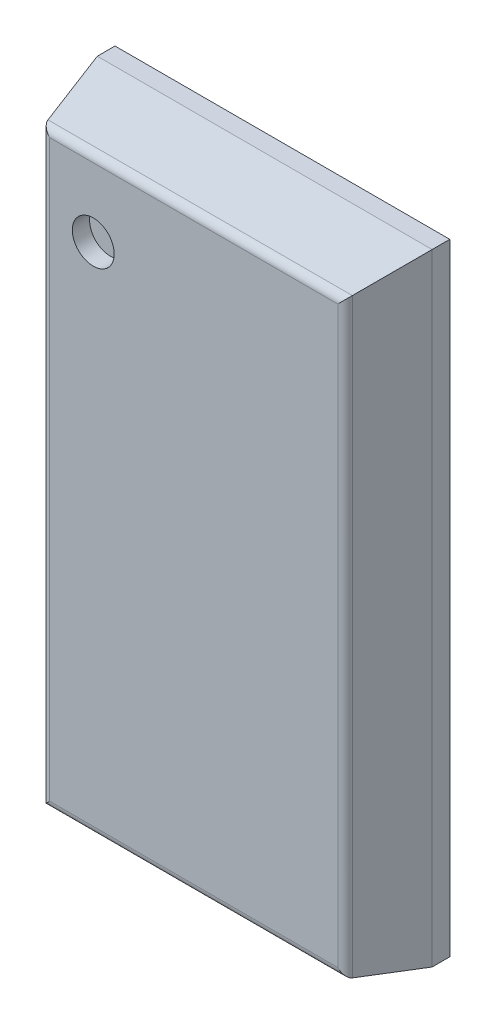
ISO-10303-21;
HEADER;
FILE_DESCRIPTION(('STEP AP214'),'2;1');
FILE_NAME('part.step','',(''),(''),'','','');
FILE_SCHEMA(('AUTOMOTIVE_DESIGN { 1 0 10303 214 1 1 1 1 }'));
ENDSEC;
DATA;
#1=APPLICATION_CONTEXT('core data for automotive mechanical design processes');
#2=APPLICATION_PROTOCOL_DEFINITION('international standard','automotive_design',2000,#1);
#3=PRODUCT_CONTEXT('',#1,'mechanical');
#4=PRODUCT('Part','Part','',(#3));
#5=PRODUCT_RELATED_PRODUCT_CATEGORY('part','',(#4));
#6=PRODUCT_DEFINITION_FORMATION('','',#4);
#7=PRODUCT_DEFINITION_CONTEXT('part definition',#1,'design');
#8=PRODUCT_DEFINITION('design','',#6,#7);
#9=PRODUCT_DEFINITION_SHAPE('','',#8);
#10=(LENGTH_UNIT() NAMED_UNIT(*) SI_UNIT(.MILLI.,.METRE.));
#11=(NAMED_UNIT(*) PLANE_ANGLE_UNIT() SI_UNIT($,.RADIAN.));
#12=(NAMED_UNIT(*) SI_UNIT($,.STERADIAN.) SOLID_ANGLE_UNIT());
#13=UNCERTAINTY_MEASURE_WITH_UNIT(LENGTH_MEASURE(1.E-05),#10,'distance_accuracy_value','');
#14=(GEOMETRIC_REPRESENTATION_CONTEXT(3) GLOBAL_UNCERTAINTY_ASSIGNED_CONTEXT((#13)) GLOBAL_UNIT_ASSIGNED_CONTEXT((#10,
#11,#12)) REPRESENTATION_CONTEXT('',''));
#15=CARTESIAN_POINT('',(0.,0.,0.));
#16=DIRECTION('',(0.,0.,1.));
#17=DIRECTION('',(1.,0.,0.));
#18=AXIS2_PLACEMENT_3D('',#15,#16,#17);
#19=CARTESIAN_POINT('',(-1.0515,2.29,1.62));
#20=DIRECTION('',(0.,0.,1.));
#21=DIRECTION('',(1.,0.,0.));
#22=AXIS2_PLACEMENT_3D('',#19,#20,#21);
#23=PLANE('',#22);
#24=CARTESIAN_POINT('',(-1.0515,2.29,1.62));
#25=DIRECTION('',(0.,0.,1.));
#26=DIRECTION('',(1.,0.,0.));
#27=AXIS2_PLACEMENT_3D('',#24,#25,#26);
#28=CIRCLE('',#27,0.2190625);
#29=CARTESIAN_POINT('',(-0.8324375,2.29,1.62));
#30=VERTEX_POINT('',#29);
#31=EDGE_CURVE('E26',#30,#30,#28,.T.);
#32=ORIENTED_EDGE('',*,*,#31,.T.);
#33=EDGE_LOOP('',(#32));
#34=FACE_BOUND('',#33,.T.);
#35=ADVANCED_FACE('F17',(#34),#23,.T.);
#36=CARTESIAN_POINT('',(-1.0515,2.29,1.62));
#37=DIRECTION('',(0.,0.,1.));
#38=DIRECTION('',(1.,0.,0.));
#39=AXIS2_PLACEMENT_3D('',#36,#37,#38);
#40=CYLINDRICAL_SURFACE('',#39,0.2190625);
#41=ORIENTED_EDGE('',*,*,#31,.F.);
#42=DIRECTION('',(0.,0.,1.));
#43=VECTOR('',#42,1.);
#44=CARTESIAN_POINT('',(-0.8324375,2.29,1.62));
#45=LINE('',#44,#43);
#46=CARTESIAN_POINT('',(-0.8324375,2.29,1.8));
#47=VERTEX_POINT('',#46);
#48=EDGE_CURVE('E11',#30,#47,#45,.T.);
#49=ORIENTED_EDGE('',*,*,#48,.T.);
#50=CARTESIAN_POINT('',(-1.0515,2.29,1.8));
#51=DIRECTION('',(0.,0.,1.));
#52=DIRECTION('',(1.,0.,0.));
#53=AXIS2_PLACEMENT_3D('',#50,#51,#52);
#54=CIRCLE('',#53,0.2190625);
#55=EDGE_CURVE('E209',#47,#47,#54,.T.);
#56=ORIENTED_EDGE('',*,*,#55,.T.);
#57=ORIENTED_EDGE('',*,*,#48,.F.);
#58=EDGE_LOOP('',(#41,#49,#56,#57));
#59=FACE_BOUND('',#58,.T.);
#60=ADVANCED_FACE('F671',(#59),#40,.F.);
#61=CARTESIAN_POINT('',(1.507884257852,-3.07725,1.712375));
#62=DIRECTION('',(0.,1.,0.));
#63=DIRECTION('',(0.,0.,1.));
#64=AXIS2_PLACEMENT_3D('',#61,#62,#63);
#65=CYLINDRICAL_SURFACE('',#64,0.087625);
#66=CARTESIAN_POINT('',(1.507884257852,-3.007884257852,1.712375));
#67=DIRECTION('',(-0.707106781186548,-0.707106781186548,0.));
#68=DIRECTION('',(0.707106781186548,-0.707106781186548,0.));
#69=AXIS2_PLACEMENT_3D('',#66,#67,#68);
#70=ELLIPSE('',#69,0.123920463403,0.087625);
#71=CARTESIAN_POINT('',(1.593170201742,-3.093170201742,1.732485902507));
#72=VERTEX_POINT('',#71);
#73=CARTESIAN_POINT('',(1.507884257852,-3.007884257852,1.8));
#74=VERTEX_POINT('',#73);
#75=EDGE_CURVE('E208',#72,#74,#70,.T.);
#76=ORIENTED_EDGE('',*,*,#75,.F.);
#77=DIRECTION('',(0.,1.,0.));
#78=VECTOR('',#77,1.);
#79=CARTESIAN_POINT('',(1.593170201742,-3.07725,1.732485902507));
#80=LINE('',#79,#78);
#81=CARTESIAN_POINT('',(1.593170201742,3.093170201742,1.732485902507));
#82=VERTEX_POINT('',#81);
#83=EDGE_CURVE('E152',#72,#82,#80,.T.);
#84=ORIENTED_EDGE('',*,*,#83,.T.);
#85=CARTESIAN_POINT('',(1.507884257852,3.007884257852,1.712375));
#86=DIRECTION('',(-0.707106781186548,0.707106781186548,0.));
#87=DIRECTION('',(0.707106781186548,0.707106781186548,0.));
#88=AXIS2_PLACEMENT_3D('',#85,#86,#87);
#89=ELLIPSE('',#88,0.123920463403,0.087625);
#90=CARTESIAN_POINT('',(1.507884257852,3.007884257852,1.8));
#91=VERTEX_POINT('',#90);
#92=EDGE_CURVE('E20',#91,#82,#89,.T.);
#93=ORIENTED_EDGE('',*,*,#92,.F.);
#94=DIRECTION('',(0.,1.,0.));
#95=VECTOR('',#94,1.);
#96=CARTESIAN_POINT('',(1.507884257852,-3.07725,1.8));
#97=LINE('',#96,#95);
#98=EDGE_CURVE('E218',#74,#91,#97,.T.);
#99=ORIENTED_EDGE('',*,*,#98,.F.);
#100=EDGE_LOOP('',(#76,#84,#93,#99));
#101=FACE_BOUND('',#100,.T.);
#102=ADVANCED_FACE('F340',(#101),#65,.T.);
#103=CARTESIAN_POINT('',(-1.57725,3.007884257852,1.712375));
#104=DIRECTION('',(1.,0.,0.));
#105=DIRECTION('',(0.,0.,1.));
#106=AXIS2_PLACEMENT_3D('',#103,#104,#105);
#107=CYLINDRICAL_SURFACE('',#106,0.087625);
#108=DIRECTION('',(1.,0.,0.));
#109=VECTOR('',#108,1.);
#110=CARTESIAN_POINT('',(-1.57725,3.007884257852,1.8));
#111=LINE('',#110,#109);
#112=CARTESIAN_POINT('',(-1.507884257852,3.007884257852,1.8));
#113=VERTEX_POINT('',#112);
#114=EDGE_CURVE('E212',#113,#91,#111,.T.);
#115=ORIENTED_EDGE('',*,*,#114,.T.);
#116=ORIENTED_EDGE('',*,*,#92,.T.);
#117=DIRECTION('',(1.,0.,0.));
#118=VECTOR('',#117,1.);
#119=CARTESIAN_POINT('',(-1.57725,3.093170201742,1.732485902507));
#120=LINE('',#119,#118);
#121=CARTESIAN_POINT('',(-1.593170201742,3.093170201742,1.732485902507));
#122=VERTEX_POINT('',#121);
#123=EDGE_CURVE('E148',#122,#82,#120,.T.);
#124=ORIENTED_EDGE('',*,*,#123,.F.);
#125=CARTESIAN_POINT('',(-1.507884257852,3.007884257852,1.712375));
#126=DIRECTION('',(0.707106781186548,0.707106781186548,0.));
#127=DIRECTION('',(-0.707106781186548,0.707106781186548,0.));
#128=AXIS2_PLACEMENT_3D('',#125,#126,#127);
#129=ELLIPSE('',#128,0.123920463403,0.087625);
#130=EDGE_CURVE('E201',#122,#113,#129,.T.);
#131=ORIENTED_EDGE('',*,*,#130,.T.);
#132=EDGE_LOOP('',(#115,#116,#124,#131));
#133=FACE_BOUND('',#132,.T.);
#134=ADVANCED_FACE('F337',(#133),#107,.T.);
#135=CARTESIAN_POINT('',(-1.7525,-3.2525,1.8));
#136=DIRECTION('',(0.,0.,1.));
#137=DIRECTION('',(1.,0.,0.));
#138=AXIS2_PLACEMENT_3D('',#135,#136,#137);
#139=PLANE('',#138);
#140=ORIENTED_EDGE('',*,*,#55,.F.);
#141=EDGE_LOOP('',(#140));
#142=FACE_BOUND('',#141,.T.);
#143=DIRECTION('',(0.,1.,0.));
#144=VECTOR('',#143,1.);
#145=CARTESIAN_POINT('',(-1.507884257852,-3.07725,1.8));
#146=LINE('',#145,#144);
#147=CARTESIAN_POINT('',(-1.507884257852,-3.007884257852,1.8));
#148=VERTEX_POINT('',#147);
#149=EDGE_CURVE('E197',#148,#113,#146,.T.);
#150=ORIENTED_EDGE('',*,*,#149,.F.);
#151=DIRECTION('',(1.,0.,0.));
#152=VECTOR('',#151,1.);
#153=CARTESIAN_POINT('',(-1.57725,-3.007884257852,1.8));
#154=LINE('',#153,#152);
#155=EDGE_CURVE('E215',#148,#74,#154,.T.);
#156=ORIENTED_EDGE('',*,*,#155,.T.);
#157=ORIENTED_EDGE('',*,*,#98,.T.);
#158=ORIENTED_EDGE('',*,*,#114,.F.);
#159=EDGE_LOOP('',(#150,#156,#157,#158));
#160=FACE_BOUND('',#159,.T.);
#161=ADVANCED_FACE('F520',(#142,#160),#139,.T.);
#162=CARTESIAN_POINT('',(-1.57725,-3.007884257852,1.712375));
#163=DIRECTION('',(1.,0.,0.));
#164=DIRECTION('',(0.,-0.973306064374652,0.229511012919918));
#165=AXIS2_PLACEMENT_3D('',#162,#163,#164);
#166=CYLINDRICAL_SURFACE('',#165,0.087625);
#167=DIRECTION('',(1.,0.,0.));
#168=VECTOR('',#167,1.);
#169=CARTESIAN_POINT('',(-1.57725,-3.093170201742,1.732485902507));
#170=LINE('',#169,#168);
#171=CARTESIAN_POINT('',(-1.593170201742,-3.093170201742,1.732485902507));
#172=VERTEX_POINT('',#171);
#173=EDGE_CURVE('E192',#172,#72,#170,.T.);
#174=ORIENTED_EDGE('',*,*,#173,.T.);
#175=ORIENTED_EDGE('',*,*,#75,.T.);
#176=ORIENTED_EDGE('',*,*,#155,.F.);
#177=CARTESIAN_POINT('',(-1.507884257852,-3.007884257852,1.712375));
#178=DIRECTION('',(-0.707106781186548,0.707106781186548,0.));
#179=DIRECTION('',(0.707106781186548,0.707106781186548,0.));
#180=AXIS2_PLACEMENT_3D('',#177,#178,#179);
#181=ELLIPSE('',#180,0.123920463403,0.087625);
#182=EDGE_CURVE('E196',#172,#148,#181,.T.);
#183=ORIENTED_EDGE('',*,*,#182,.F.);
#184=EDGE_LOOP('',(#174,#175,#176,#183));
#185=FACE_BOUND('',#184,.T.);
#186=ADVANCED_FACE('F343',(#185),#166,.T.);
#187=CARTESIAN_POINT('',(1.664875,-3.2525,1.42840151849));
#188=DIRECTION('',(0.973306064374652,0.,0.229511012919918));
#189=DIRECTION('',(0.,-1.,0.));
#190=AXIS2_PLACEMENT_3D('',#187,#188,#189);
#191=PLANE('',#190);
#192=DIRECTION('',(-0.223695018205087,0.223695018205087,0.948641701413369));
#193=VECTOR('',#192,1.);
#194=CARTESIAN_POINT('',(1.581565552085,-3.081565552085,1.781698686428));
#195=LINE('',#194,#193);
#196=CARTESIAN_POINT('',(1.7525,-3.2525,1.056803036979));
#197=VERTEX_POINT('',#196);
#198=EDGE_CURVE('E158',#197,#72,#195,.T.);
#199=ORIENTED_EDGE('',*,*,#198,.F.);
#200=DIRECTION('',(0.,1.,0.));
#201=VECTOR('',#200,1.);
#202=CARTESIAN_POINT('',(1.7525,-3.2525,1.056803036979));
#203=LINE('',#202,#201);
#204=CARTESIAN_POINT('',(1.7525,3.2525,1.056803036979));
#205=VERTEX_POINT('',#204);
#206=EDGE_CURVE('E155',#197,#205,#203,.T.);
#207=ORIENTED_EDGE('',*,*,#206,.T.);
#208=DIRECTION('',(-0.223695018205087,-0.223695018205087,0.948641701413369));
#209=VECTOR('',#208,1.);
#210=CARTESIAN_POINT('',(1.418812204631,2.918812204631,2.471900076154));
#211=LINE('',#210,#209);
#212=EDGE_CURVE('E141',#205,#82,#211,.T.);
#213=ORIENTED_EDGE('',*,*,#212,.T.);
#214=ORIENTED_EDGE('',*,*,#83,.F.);
#215=EDGE_LOOP('',(#199,#207,#213,#214));
#216=FACE_BOUND('',#215,.T.);
#217=ADVANCED_FACE('F156',(#216),#191,.T.);
#218=CARTESIAN_POINT('',(-1.7525,3.164875,1.42840151849));
#219=DIRECTION('',(0.,0.973306064374652,0.229511012919918));
#220=DIRECTION('',(1.,0.,0.));
#221=AXIS2_PLACEMENT_3D('',#218,#219,#220);
#222=PLANE('',#221);
#223=ORIENTED_EDGE('',*,*,#123,.T.);
#224=ORIENTED_EDGE('',*,*,#212,.F.);
#225=DIRECTION('',(1.,0.,0.));
#226=VECTOR('',#225,1.);
#227=CARTESIAN_POINT('',(-1.7525,3.2525,1.056803036979));
#228=LINE('',#227,#226);
#229=CARTESIAN_POINT('',(-1.7525,3.2525,1.056803036979));
#230=VERTEX_POINT('',#229);
#231=EDGE_CURVE('E146',#230,#205,#228,.T.);
#232=ORIENTED_EDGE('',*,*,#231,.F.);
#233=DIRECTION('',(0.223695018205087,-0.223695018205087,0.948641701413369));
#234=VECTOR('',#233,1.);
#235=CARTESIAN_POINT('',(-1.506506360331,3.006506360331,2.10000832043));
#236=LINE('',#235,#234);
#237=EDGE_CURVE('E186',#230,#122,#236,.T.);
#238=ORIENTED_EDGE('',*,*,#237,.T.);
#239=EDGE_LOOP('',(#223,#224,#232,#238));
#240=FACE_BOUND('',#239,.T.);
#241=ADVANCED_FACE('F143',(#240),#222,.T.);
#242=CARTESIAN_POINT('',(-1.507884257852,-3.07725,1.712375));
#243=DIRECTION('',(0.,1.,0.));
#244=DIRECTION('',(-0.973306064374652,0.,0.229511012919918));
#245=AXIS2_PLACEMENT_3D('',#242,#243,#244);
#246=CYLINDRICAL_SURFACE('',#245,0.087625);
#247=ORIENTED_EDGE('',*,*,#182,.T.);
#248=ORIENTED_EDGE('',*,*,#149,.T.);
#249=ORIENTED_EDGE('',*,*,#130,.F.);
#250=DIRECTION('',(0.,1.,0.));
#251=VECTOR('',#250,1.);
#252=CARTESIAN_POINT('',(-1.593170201742,-3.07725,1.732485902507));
#253=LINE('',#252,#251);
#254=EDGE_CURVE('E304',#172,#122,#253,.T.);
#255=ORIENTED_EDGE('',*,*,#254,.F.);
#256=EDGE_LOOP('',(#247,#248,#249,#255));
#257=FACE_BOUND('',#256,.T.);
#258=ADVANCED_FACE('F335',(#257),#246,.T.);
#259=CARTESIAN_POINT('',(-1.7525,-3.164875,1.42840151849));
#260=DIRECTION('',(0.,0.973306064374652,-0.229511012919918));
#261=DIRECTION('',(-1.,0.,0.));
#262=AXIS2_PLACEMENT_3D('',#259,#260,#261);
#263=PLANE('',#262);
#264=DIRECTION('',(0.223695018205087,0.223695018205087,0.948641701413369));
#265=VECTOR('',#264,1.);
#266=CARTESIAN_POINT('',(-1.669259707785,-3.169259707785,1.409806930703));
#267=LINE('',#266,#265);
#268=CARTESIAN_POINT('',(-1.7525,-3.2525,1.056803036979));
#269=VERTEX_POINT('',#268);
#270=EDGE_CURVE('E179',#269,#172,#267,.T.);
#271=ORIENTED_EDGE('',*,*,#270,.F.);
#272=DIRECTION('',(1.,0.,0.));
#273=VECTOR('',#272,1.);
#274=CARTESIAN_POINT('',(-1.7525,-3.2525,1.056803036979));
#275=LINE('',#274,#273);
#276=EDGE_CURVE('E289',#269,#197,#275,.T.);
#277=ORIENTED_EDGE('',*,*,#276,.T.);
#278=ORIENTED_EDGE('',*,*,#198,.T.);
#279=ORIENTED_EDGE('',*,*,#173,.F.);
#280=EDGE_LOOP('',(#271,#277,#278,#279));
#281=FACE_BOUND('',#280,.T.);
#282=ADVANCED_FACE('F345',(#281),#263,.F.);
#283=CARTESIAN_POINT('',(1.7525,-3.2525,0.74));
#284=DIRECTION('',(1.,0.,0.));
#285=DIRECTION('',(0.,1.,0.));
#286=AXIS2_PLACEMENT_3D('',#283,#284,#285);
#287=PLANE('',#286);
#288=DIRECTION('',(0.,0.,1.));
#289=VECTOR('',#288,1.);
#290=CARTESIAN_POINT('',(1.7525,-3.2525,0.74));
#291=LINE('',#290,#289);
#292=CARTESIAN_POINT('',(1.7525,-3.2525,0.871803036979));
#293=VERTEX_POINT('',#292);
#294=EDGE_CURVE('E285',#293,#197,#291,.T.);
#295=ORIENTED_EDGE('',*,*,#294,.F.);
#296=DIRECTION('',(0.,1.,0.));
#297=VECTOR('',#296,1.);
#298=CARTESIAN_POINT('',(1.7525,-3.2525,0.871803036979));
#299=LINE('',#298,#297);
#300=CARTESIAN_POINT('',(1.7525,3.2525,0.871803036979));
#301=VERTEX_POINT('',#300);
#302=EDGE_CURVE('E176',#293,#301,#299,.T.);
#303=ORIENTED_EDGE('',*,*,#302,.T.);
#304=DIRECTION('',(0.,0.,1.));
#305=VECTOR('',#304,1.);
#306=CARTESIAN_POINT('',(1.7525,3.2525,0.74));
#307=LINE('',#306,#305);
#308=EDGE_CURVE('E168',#301,#205,#307,.T.);
#309=ORIENTED_EDGE('',*,*,#308,.T.);
#310=ORIENTED_EDGE('',*,*,#206,.F.);
#311=EDGE_LOOP('',(#295,#303,#309,#310));
#312=FACE_BOUND('',#311,.T.);
#313=ADVANCED_FACE('F175',(#312),#287,.T.);
#314=CARTESIAN_POINT('',(1.547976732908,-3.07725,0.827625));
#315=DIRECTION('',(0.,1.,0.));
#316=DIRECTION('',(0.,0.,-1.));
#317=AXIS2_PLACEMENT_3D('',#314,#315,#316);
#318=CYLINDRICAL_SURFACE('',#317,0.087625);
#319=DIRECTION('',(0.,1.,0.));
#320=VECTOR('',#319,1.);
#321=CARTESIAN_POINT('',(1.547976732908,-3.07725,0.74));
#322=LINE('',#321,#320);
#323=CARTESIAN_POINT('',(1.547976732908,-3.047976732908,0.74));
#324=VERTEX_POINT('',#323);
#325=CARTESIAN_POINT('',(1.547976732908,3.047976732908,0.74));
#326=VERTEX_POINT('',#325);
#327=EDGE_CURVE('E321',#324,#326,#322,.T.);
#328=ORIENTED_EDGE('',*,*,#327,.T.);
#329=CARTESIAN_POINT('',(1.547976732908,3.047976732908,0.827625));
#330=DIRECTION('',(0.707106781186548,-0.707106781186548,0.));
#331=DIRECTION('',(0.707106781186548,0.707106781186548,0.));
#332=AXIS2_PLACEMENT_3D('',#329,#330,#331);
#333=ELLIPSE('',#332,0.123920463403,0.087625);
#334=CARTESIAN_POINT('',(1.600645169946,3.100645169946,0.757595175176));
#335=VERTEX_POINT('',#334);
#336=EDGE_CURVE('E308',#326,#335,#333,.T.);
#337=ORIENTED_EDGE('',*,*,#336,.T.);
#338=DIRECTION('',(0.,1.,0.));
#339=VECTOR('',#338,1.);
#340=CARTESIAN_POINT('',(1.600645169946,-3.07725,0.757595175176));
#341=LINE('',#340,#339);
#342=CARTESIAN_POINT('',(1.600645169946,-3.100645169946,0.757595175176));
#343=VERTEX_POINT('',#342);
#344=EDGE_CURVE('E288',#343,#335,#341,.T.);
#345=ORIENTED_EDGE('',*,*,#344,.F.);
#346=CARTESIAN_POINT('',(1.547976732908,-3.047976732908,0.827625));
#347=DIRECTION('',(0.707106781186548,0.707106781186548,0.));
#348=DIRECTION('',(0.707106781186548,-0.707106781186548,0.));
#349=AXIS2_PLACEMENT_3D('',#346,#347,#348);
#350=ELLIPSE('',#349,0.123920463403,0.087625);
#351=EDGE_CURVE('E296',#343,#324,#350,.T.);
#352=ORIENTED_EDGE('',*,*,#351,.T.);
#353=EDGE_LOOP('',(#328,#337,#345,#352));
#354=FACE_BOUND('',#353,.T.);
#355=ADVANCED_FACE('F602',(#354),#318,.T.);
#356=CARTESIAN_POINT('',(-1.7525,3.2525,0.74));
#357=DIRECTION('',(0.,1.,0.));
#358=DIRECTION('',(1.,0.,0.));
#359=AXIS2_PLACEMENT_3D('',#356,#357,#358);
#360=PLANE('',#359);
#361=ORIENTED_EDGE('',*,*,#308,.F.);
#362=DIRECTION('',(1.,0.,0.));
#363=VECTOR('',#362,1.);
#364=CARTESIAN_POINT('',(-1.7525,3.2525,0.871803036979));
#365=LINE('',#364,#363);
#366=CARTESIAN_POINT('',(-1.7525,3.2525,0.871803036979));
#367=VERTEX_POINT('',#366);
#368=EDGE_CURVE('E240',#367,#301,#365,.T.);
#369=ORIENTED_EDGE('',*,*,#368,.F.);
#370=DIRECTION('',(0.,0.,1.));
#371=VECTOR('',#370,1.);
#372=CARTESIAN_POINT('',(-1.7525,3.2525,0.74));
#373=LINE('',#372,#371);
#374=EDGE_CURVE('E171',#367,#230,#373,.T.);
#375=ORIENTED_EDGE('',*,*,#374,.T.);
#376=ORIENTED_EDGE('',*,*,#231,.T.);
#377=EDGE_LOOP('',(#361,#369,#375,#376));
#378=FACE_BOUND('',#377,.T.);
#379=ADVANCED_FACE('F167',(#378),#360,.T.);
#380=CARTESIAN_POINT('',(-1.664875,-3.2525,1.42840151849));
#381=DIRECTION('',(0.973306064374652,0.,-0.229511012919918));
#382=DIRECTION('',(0.,-1.,0.));
#383=AXIS2_PLACEMENT_3D('',#380,#381,#382);
#384=PLANE('',#383);
#385=ORIENTED_EDGE('',*,*,#254,.T.);
#386=ORIENTED_EDGE('',*,*,#237,.F.);
#387=DIRECTION('',(0.,1.,0.));
#388=VECTOR('',#387,1.);
#389=CARTESIAN_POINT('',(-1.7525,-3.2525,1.056803036979));
#390=LINE('',#389,#388);
#391=EDGE_CURVE('E251',#269,#230,#390,.T.);
#392=ORIENTED_EDGE('',*,*,#391,.F.);
#393=ORIENTED_EDGE('',*,*,#270,.T.);
#394=EDGE_LOOP('',(#385,#386,#392,#393));
#395=FACE_BOUND('',#394,.T.);
#396=ADVANCED_FACE('F332',(#395),#384,.F.);
#397=CARTESIAN_POINT('',(-1.57725,3.047976732908,0.827625));
#398=DIRECTION('',(1.,0.,0.));
#399=DIRECTION('',(0.,0.,-1.));
#400=AXIS2_PLACEMENT_3D('',#397,#398,#399);
#401=CYLINDRICAL_SURFACE('',#400,0.087625);
#402=CARTESIAN_POINT('',(-1.547976732908,3.047976732908,0.827625));
#403=DIRECTION('',(-0.707106781186548,-0.707106781186548,0.));
#404=DIRECTION('',(-0.707106781186548,0.707106781186548,0.));
#405=AXIS2_PLACEMENT_3D('',#402,#403,#404);
#406=ELLIPSE('',#405,0.123920463403,0.087625);
#407=CARTESIAN_POINT('',(-1.600645169946,3.100645169946,0.757595175176));
#408=VERTEX_POINT('',#407);
#409=CARTESIAN_POINT('',(-1.547976732908,3.047976732908,0.74));
#410=VERTEX_POINT('',#409);
#411=EDGE_CURVE('E269',#408,#410,#406,.T.);
#412=ORIENTED_EDGE('',*,*,#411,.F.);
#413=DIRECTION('',(1.,0.,0.));
#414=VECTOR('',#413,1.);
#415=CARTESIAN_POINT('',(-1.57725,3.100645169946,0.757595175176));
#416=LINE('',#415,#414);
#417=EDGE_CURVE('E255',#408,#335,#416,.T.);
#418=ORIENTED_EDGE('',*,*,#417,.T.);
#419=ORIENTED_EDGE('',*,*,#336,.F.);
#420=DIRECTION('',(1.,0.,0.));
#421=VECTOR('',#420,1.);
#422=CARTESIAN_POINT('',(-1.57725,3.047976732908,0.74));
#423=LINE('',#422,#421);
#424=EDGE_CURVE('E317',#410,#326,#423,.T.);
#425=ORIENTED_EDGE('',*,*,#424,.F.);
#426=EDGE_LOOP('',(#412,#418,#419,#425));
#427=FACE_BOUND('',#426,.T.);
#428=ADVANCED_FACE('F549',(#427),#401,.T.);
#429=CARTESIAN_POINT('',(-1.7525,-3.2525,0.74));
#430=DIRECTION('',(0.,0.,1.));
#431=DIRECTION('',(1.,0.,0.));
#432=AXIS2_PLACEMENT_3D('',#429,#430,#431);
#433=PLANE('',#432);
#434=ORIENTED_EDGE('',*,*,#424,.T.);
#435=ORIENTED_EDGE('',*,*,#327,.F.);
#436=DIRECTION('',(1.,0.,0.));
#437=VECTOR('',#436,1.);
#438=CARTESIAN_POINT('',(-1.57725,-3.047976732908,0.74));
#439=LINE('',#438,#437);
#440=CARTESIAN_POINT('',(-1.547976732908,-3.047976732908,0.74));
#441=VERTEX_POINT('',#440);
#442=EDGE_CURVE('E259',#441,#324,#439,.T.);
#443=ORIENTED_EDGE('',*,*,#442,.F.);
#444=DIRECTION('',(0.,1.,0.));
#445=VECTOR('',#444,1.);
#446=CARTESIAN_POINT('',(-1.547976732908,-3.07725,0.74));
#447=LINE('',#446,#445);
#448=EDGE_CURVE('E273',#441,#410,#447,.T.);
#449=ORIENTED_EDGE('',*,*,#448,.T.);
#450=EDGE_LOOP('',(#434,#435,#443,#449));
#451=FACE_BOUND('',#450,.T.);
#452=ADVANCED_FACE('F554',(#451),#433,.F.);
#453=CARTESIAN_POINT('',(1.664875,-3.2525,0.80590151849));
#454=DIRECTION('',(-0.601066328540768,0.,0.799199142075692));
#455=DIRECTION('',(0.,1.,0.));
#456=AXIS2_PLACEMENT_3D('',#453,#454,#455);
#457=PLANE('',#456);
#458=ORIENTED_EDGE('',*,*,#344,.T.);
#459=DIRECTION('',(-0.624313503926429,-0.624313503926429,-0.469537322936323));
#460=VECTOR('',#459,1.);
#461=CARTESIAN_POINT('',(-0.251757228533,1.248242771467,-0.635570370199));
#462=LINE('',#461,#460);
#463=EDGE_CURVE('E244',#301,#335,#462,.T.);
#464=ORIENTED_EDGE('',*,*,#463,.F.);
#465=ORIENTED_EDGE('',*,*,#302,.F.);
#466=DIRECTION('',(-0.624313503926429,0.624313503926429,-0.469537322936323));
#467=VECTOR('',#466,1.);
#468=CARTESIAN_POINT('',(1.015961081196,-2.515961081196,0.317862572775));
#469=LINE('',#468,#467);
#470=EDGE_CURVE('E246',#293,#343,#469,.T.);
#471=ORIENTED_EDGE('',*,*,#470,.T.);
#472=EDGE_LOOP('',(#458,#464,#465,#471));
#473=FACE_BOUND('',#472,.T.);
#474=ADVANCED_FACE('F567',(#473),#457,.F.);
#475=CARTESIAN_POINT('',(-1.7525,-3.2525,0.74));
#476=DIRECTION('',(0.,1.,0.));
#477=DIRECTION('',(1.,0.,0.));
#478=AXIS2_PLACEMENT_3D('',#475,#476,#477);
#479=PLANE('',#478);
#480=ORIENTED_EDGE('',*,*,#276,.F.);
#481=DIRECTION('',(0.,0.,1.));
#482=VECTOR('',#481,1.);
#483=CARTESIAN_POINT('',(-1.7525,-3.2525,0.74));
#484=LINE('',#483,#482);
#485=CARTESIAN_POINT('',(-1.7525,-3.2525,0.871803036979));
#486=VERTEX_POINT('',#485);
#487=EDGE_CURVE('E245',#486,#269,#484,.T.);
#488=ORIENTED_EDGE('',*,*,#487,.F.);
#489=DIRECTION('',(1.,0.,0.));
#490=VECTOR('',#489,1.);
#491=CARTESIAN_POINT('',(-1.7525,-3.2525,0.871803036979));
#492=LINE('',#491,#490);
#493=EDGE_CURVE('E250',#486,#293,#492,.T.);
#494=ORIENTED_EDGE('',*,*,#493,.T.);
#495=ORIENTED_EDGE('',*,*,#294,.T.);
#496=EDGE_LOOP('',(#480,#488,#494,#495));
#497=FACE_BOUND('',#496,.T.);
#498=ADVANCED_FACE('F348',(#497),#479,.F.);
#499=CARTESIAN_POINT('',(-1.57725,-3.047976732908,0.827625));
#500=DIRECTION('',(1.,0.,0.));
#501=DIRECTION('',(0.,-0.601066328540768,-0.799199142075692));
#502=AXIS2_PLACEMENT_3D('',#499,#500,#501);
#503=CYLINDRICAL_SURFACE('',#502,0.087625);
#504=CARTESIAN_POINT('',(-1.547976732908,-3.047976732908,0.827625));
#505=DIRECTION('',(0.707106781186548,-0.707106781186548,0.));
#506=DIRECTION('',(0.707106781186548,0.707106781186548,0.));
#507=AXIS2_PLACEMENT_3D('',#504,#505,#506);
#508=ELLIPSE('',#507,0.123920463403,0.087625);
#509=CARTESIAN_POINT('',(-1.600645169946,-3.100645169946,0.757595175176));
#510=VERTEX_POINT('',#509);
#511=EDGE_CURVE('E254',#510,#441,#508,.T.);
#512=ORIENTED_EDGE('',*,*,#511,.T.);
#513=ORIENTED_EDGE('',*,*,#442,.T.);
#514=ORIENTED_EDGE('',*,*,#351,.F.);
#515=DIRECTION('',(1.,0.,0.));
#516=VECTOR('',#515,1.);
#517=CARTESIAN_POINT('',(-1.57725,-3.100645169946,0.757595175176));
#518=LINE('',#517,#516);
#519=EDGE_CURVE('E239',#510,#343,#518,.T.);
#520=ORIENTED_EDGE('',*,*,#519,.F.);
#521=EDGE_LOOP('',(#512,#513,#514,#520));
#522=FACE_BOUND('',#521,.T.);
#523=ADVANCED_FACE('F543',(#522),#503,.T.);
#524=CARTESIAN_POINT('',(-1.7525,3.164875,0.80590151849));
#525=DIRECTION('',(0.,-0.601066328540768,0.799199142075692));
#526=DIRECTION('',(-1.,0.,0.));
#527=AXIS2_PLACEMENT_3D('',#524,#525,#526);
#528=PLANE('',#527);
#529=DIRECTION('',(0.624313503926429,-0.624313503926429,-0.469537322936323));
#530=VECTOR('',#529,1.);
#531=CARTESIAN_POINT('',(-0.431310054419,1.931310054419,-0.121845164185));
#532=LINE('',#531,#530);
#533=EDGE_CURVE('E233',#367,#408,#532,.T.);
#534=ORIENTED_EDGE('',*,*,#533,.F.);
#535=ORIENTED_EDGE('',*,*,#368,.T.);
#536=ORIENTED_EDGE('',*,*,#463,.T.);
#537=ORIENTED_EDGE('',*,*,#417,.F.);
#538=EDGE_LOOP('',(#534,#535,#536,#537));
#539=FACE_BOUND('',#538,.T.);
#540=ADVANCED_FACE('F538',(#539),#528,.F.);
#541=CARTESIAN_POINT('',(-1.7525,-3.2525,0.74));
#542=DIRECTION('',(1.,0.,0.));
#543=DIRECTION('',(0.,1.,0.));
#544=AXIS2_PLACEMENT_3D('',#541,#542,#543);
#545=PLANE('',#544);
#546=ORIENTED_EDGE('',*,*,#391,.T.);
#547=ORIENTED_EDGE('',*,*,#374,.F.);
#548=DIRECTION('',(0.,1.,0.));
#549=VECTOR('',#548,1.);
#550=CARTESIAN_POINT('',(-1.7525,-3.2525,0.871803036979));
#551=LINE('',#550,#549);
#552=EDGE_CURVE('E354',#486,#367,#551,.T.);
#553=ORIENTED_EDGE('',*,*,#552,.F.);
#554=ORIENTED_EDGE('',*,*,#487,.T.);
#555=EDGE_LOOP('',(#546,#547,#553,#554));
#556=FACE_BOUND('',#555,.T.);
#557=ADVANCED_FACE('F352',(#556),#545,.F.);
#558=CARTESIAN_POINT('',(-1.547976732908,-3.07725,0.827625));
#559=DIRECTION('',(0.,1.,0.));
#560=DIRECTION('',(-0.601066328540768,0.,-0.799199142075692));
#561=AXIS2_PLACEMENT_3D('',#558,#559,#560);
#562=CYLINDRICAL_SURFACE('',#561,0.087625);
#563=DIRECTION('',(0.,1.,0.));
#564=VECTOR('',#563,1.);
#565=CARTESIAN_POINT('',(-1.600645169946,-3.07725,0.757595175176));
#566=LINE('',#565,#564);
#567=EDGE_CURVE('E235',#510,#408,#566,.T.);
#568=ORIENTED_EDGE('',*,*,#567,.T.);
#569=ORIENTED_EDGE('',*,*,#411,.T.);
#570=ORIENTED_EDGE('',*,*,#448,.F.);
#571=ORIENTED_EDGE('',*,*,#511,.F.);
#572=EDGE_LOOP('',(#568,#569,#570,#571));
#573=FACE_BOUND('',#572,.T.);
#574=ADVANCED_FACE('F504',(#573),#562,.T.);
#575=CARTESIAN_POINT('',(-1.7525,-3.164875,0.80590151849));
#576=DIRECTION('',(0.,-0.601066328540768,-0.799199142075692));
#577=DIRECTION('',(0.,-0.799199142075692,0.601066328540768));
#578=AXIS2_PLACEMENT_3D('',#575,#576,#577);
#579=PLANE('',#578);
#580=ORIENTED_EDGE('',*,*,#519,.T.);
#581=ORIENTED_EDGE('',*,*,#470,.F.);
#582=ORIENTED_EDGE('',*,*,#493,.F.);
#583=DIRECTION('',(0.624313503926429,0.624313503926429,-0.469537322936323));
#584=VECTOR('',#583,1.);
#585=CARTESIAN_POINT('',(-1.699028364148,-3.199028364148,0.83158777879));
#586=LINE('',#585,#584);
#587=EDGE_CURVE('E360',#486,#510,#586,.T.);
#588=ORIENTED_EDGE('',*,*,#587,.T.);
#589=EDGE_LOOP('',(#580,#581,#582,#588));
#590=FACE_BOUND('',#589,.T.);
#591=ADVANCED_FACE('F509',(#590),#579,.T.);
#592=CARTESIAN_POINT('',(-1.664875,-3.2525,0.80590151849));
#593=DIRECTION('',(-0.601066328540768,0.,-0.799199142075692));
#594=DIRECTION('',(-0.799199142075692,0.,0.601066328540768));
#595=AXIS2_PLACEMENT_3D('',#592,#593,#594);
#596=PLANE('',#595);
#597=ORIENTED_EDGE('',*,*,#587,.F.);
#598=ORIENTED_EDGE('',*,*,#552,.T.);
#599=ORIENTED_EDGE('',*,*,#533,.T.);
#600=ORIENTED_EDGE('',*,*,#567,.F.);
#601=EDGE_LOOP('',(#597,#598,#599,#600));
#602=FACE_BOUND('',#601,.T.);
#603=ADVANCED_FACE('F363',(#602),#596,.T.);
#604=CLOSED_SHELL('',(#35,#60,#102,#134,#161,#186,#217,#241,#258,#282,#313,#355,#379,#396,#428,
#452,#474,#498,#523,#540,#557,#574,#591,#603));
#605=MANIFOLD_SOLID_BREP('B1',#604);
#606=ADVANCED_BREP_SHAPE_REPRESENTATION('',(#18,#605),#14);
#607=SHAPE_DEFINITION_REPRESENTATION(#9,#606);
ENDSEC;
END-ISO-10303-21;
